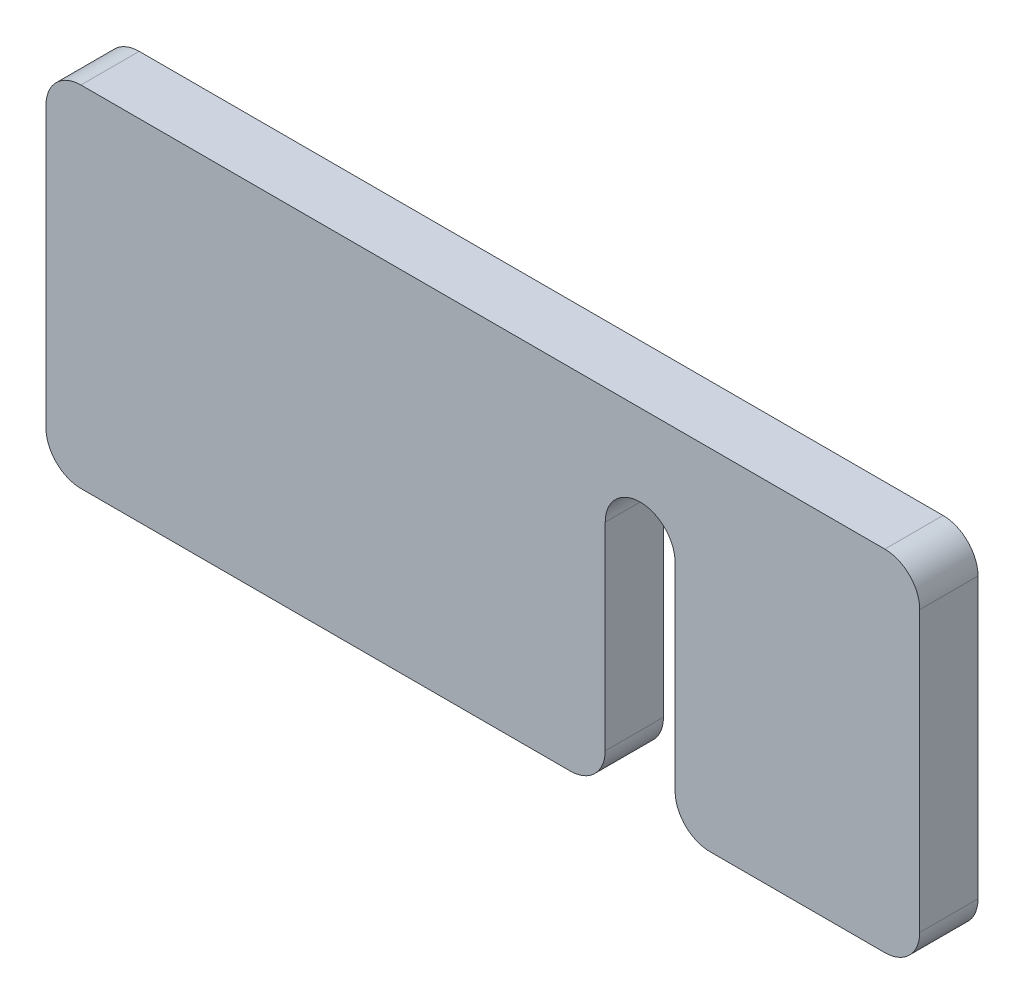
ISO-10303-21;
HEADER;
FILE_DESCRIPTION(('STEP AP214'),'2;1');
FILE_NAME('part.step','',(''),(''),'','','');
FILE_SCHEMA(('AUTOMOTIVE_DESIGN { 1 0 10303 214 1 1 1 1 }'));
ENDSEC;
DATA;
#1=APPLICATION_CONTEXT('core data for automotive mechanical design processes');
#2=APPLICATION_PROTOCOL_DEFINITION('international standard','automotive_design',2000,#1);
#3=PRODUCT_CONTEXT('',#1,'mechanical');
#4=PRODUCT('Part','Part','',(#3));
#5=PRODUCT_RELATED_PRODUCT_CATEGORY('part','',(#4));
#6=PRODUCT_DEFINITION_FORMATION('','',#4);
#7=PRODUCT_DEFINITION_CONTEXT('part definition',#1,'design');
#8=PRODUCT_DEFINITION('design','',#6,#7);
#9=PRODUCT_DEFINITION_SHAPE('','',#8);
#10=(LENGTH_UNIT() NAMED_UNIT(*) SI_UNIT(.MILLI.,.METRE.));
#11=(NAMED_UNIT(*) PLANE_ANGLE_UNIT() SI_UNIT($,.RADIAN.));
#12=(NAMED_UNIT(*) SI_UNIT($,.STERADIAN.) SOLID_ANGLE_UNIT());
#13=UNCERTAINTY_MEASURE_WITH_UNIT(LENGTH_MEASURE(1.E-05),#10,'distance_accuracy_value','');
#14=(GEOMETRIC_REPRESENTATION_CONTEXT(3) GLOBAL_UNCERTAINTY_ASSIGNED_CONTEXT((#13)) GLOBAL_UNIT_ASSIGNED_CONTEXT((#10,
#11,#12)) REPRESENTATION_CONTEXT('',''));
#15=CARTESIAN_POINT('',(0.,0.,0.));
#16=DIRECTION('',(0.,0.,1.));
#17=DIRECTION('',(1.,0.,0.));
#18=AXIS2_PLACEMENT_3D('',#15,#16,#17);
#19=CARTESIAN_POINT('',(37.5,-15.,2.5));
#20=DIRECTION('',(0.,1.,0.));
#21=DIRECTION('',(0.,0.,1.));
#22=AXIS2_PLACEMENT_3D('',#19,#20,#21);
#23=PLANE('',#22);
#24=DIRECTION('',(-1.,0.,0.));
#25=VECTOR('',#24,1.);
#26=CARTESIAN_POINT('',(37.5,-15.,-2.5));
#27=LINE('',#26,#25);
#28=CARTESIAN_POINT('',(34.5,-15.,-2.5));
#29=VERTEX_POINT('',#28);
#30=CARTESIAN_POINT('',(19.5,-15.,-2.5));
#31=VERTEX_POINT('',#30);
#32=EDGE_CURVE('E209',#29,#31,#27,.T.);
#33=ORIENTED_EDGE('',*,*,#32,.F.);
#34=DIRECTION('',(0.,0.,-1.));
#35=VECTOR('',#34,1.);
#36=CARTESIAN_POINT('',(34.5,-15.,2.5));
#37=LINE('',#36,#35);
#38=CARTESIAN_POINT('',(34.5,-15.,2.5));
#39=VERTEX_POINT('',#38);
#40=EDGE_CURVE('E247',#29,#39,#37,.F.);
#41=ORIENTED_EDGE('',*,*,#40,.T.);
#42=DIRECTION('',(-1.,0.,0.));
#43=VECTOR('',#42,1.);
#44=CARTESIAN_POINT('',(37.5,-15.,2.5));
#45=LINE('',#44,#43);
#46=CARTESIAN_POINT('',(19.5,-15.,2.5));
#47=VERTEX_POINT('',#46);
#48=EDGE_CURVE('E200',#39,#47,#45,.T.);
#49=ORIENTED_EDGE('',*,*,#48,.T.);
#50=DIRECTION('',(0.,0.,-1.));
#51=VECTOR('',#50,1.);
#52=CARTESIAN_POINT('',(19.5,-15.,2.5));
#53=LINE('',#52,#51);
#54=EDGE_CURVE('E244',#47,#31,#53,.T.);
#55=ORIENTED_EDGE('',*,*,#54,.T.);
#56=EDGE_LOOP('',(#33,#41,#49,#55));
#57=FACE_BOUND('',#56,.T.);
#58=ADVANCED_FACE('F51',(#57),#23,.F.);
#59=CARTESIAN_POINT('',(7.5,-15.,-2.5));
#60=VERTEX_POINT('',#59);
#61=CARTESIAN_POINT('',(-34.5,-15.,-2.5));
#62=VERTEX_POINT('',#61);
#63=EDGE_CURVE('E207',#60,#62,#27,.T.);
#64=ORIENTED_EDGE('',*,*,#63,.F.);
#65=DIRECTION('',(0.,0.,-1.));
#66=VECTOR('',#65,1.);
#67=CARTESIAN_POINT('',(7.5,-15.,2.5));
#68=LINE('',#67,#66);
#69=CARTESIAN_POINT('',(7.5,-15.,2.5));
#70=VERTEX_POINT('',#69);
#71=EDGE_CURVE('E256',#60,#70,#68,.F.);
#72=ORIENTED_EDGE('',*,*,#71,.T.);
#73=CARTESIAN_POINT('',(-34.5,-15.,2.5));
#74=VERTEX_POINT('',#73);
#75=EDGE_CURVE('E194',#70,#74,#45,.T.);
#76=ORIENTED_EDGE('',*,*,#75,.T.);
#77=DIRECTION('',(0.,0.,-1.));
#78=VECTOR('',#77,1.);
#79=CARTESIAN_POINT('',(-34.5,-15.,2.5));
#80=LINE('',#79,#78);
#81=EDGE_CURVE('E253',#74,#62,#80,.T.);
#82=ORIENTED_EDGE('',*,*,#81,.T.);
#83=EDGE_LOOP('',(#64,#72,#76,#82));
#84=FACE_BOUND('',#83,.T.);
#85=ADVANCED_FACE('F265',(#84),#23,.F.);
#86=CARTESIAN_POINT('',(37.5,-15.,-2.5));
#87=DIRECTION('',(0.,0.,1.));
#88=DIRECTION('',(1.,0.,0.));
#89=AXIS2_PLACEMENT_3D('',#86,#87,#88);
#90=PLANE('',#89);
#91=DIRECTION('',(-1.,0.,0.));
#92=VECTOR('',#91,1.);
#93=CARTESIAN_POINT('',(37.5,15.,-2.5));
#94=LINE('',#93,#92);
#95=CARTESIAN_POINT('',(34.5,15.,-2.5));
#96=VERTEX_POINT('',#95);
#97=CARTESIAN_POINT('',(-34.5,15.,-2.5));
#98=VERTEX_POINT('',#97);
#99=EDGE_CURVE('E204',#96,#98,#94,.T.);
#100=ORIENTED_EDGE('',*,*,#99,.F.);
#101=CARTESIAN_POINT('',(34.5,12.,-2.5));
#102=DIRECTION('',(0.,0.,1.));
#103=DIRECTION('',(1.,0.,0.));
#104=AXIS2_PLACEMENT_3D('',#101,#102,#103);
#105=CIRCLE('',#104,3.);
#106=CARTESIAN_POINT('',(37.5,12.,-2.5));
#107=VERTEX_POINT('',#106);
#108=EDGE_CURVE('E242',#96,#107,#105,.F.);
#109=ORIENTED_EDGE('',*,*,#108,.T.);
#110=DIRECTION('',(0.,1.,0.));
#111=VECTOR('',#110,1.);
#112=CARTESIAN_POINT('',(37.5,-15.,-2.5));
#113=LINE('',#112,#111);
#114=CARTESIAN_POINT('',(37.5,-12.,-2.5));
#115=VERTEX_POINT('',#114);
#116=EDGE_CURVE('E187',#115,#107,#113,.T.);
#117=ORIENTED_EDGE('',*,*,#116,.F.);
#118=CARTESIAN_POINT('',(34.5,-12.,-2.5));
#119=DIRECTION('',(0.,0.,1.));
#120=DIRECTION('',(1.,0.,0.));
#121=AXIS2_PLACEMENT_3D('',#118,#119,#120);
#122=CIRCLE('',#121,3.);
#123=EDGE_CURVE('E240',#115,#29,#122,.F.);
#124=ORIENTED_EDGE('',*,*,#123,.T.);
#125=ORIENTED_EDGE('',*,*,#32,.T.);
#126=CARTESIAN_POINT('',(19.5,-12.,-2.5));
#127=DIRECTION('',(0.,0.,1.));
#128=DIRECTION('',(1.,0.,0.));
#129=AXIS2_PLACEMENT_3D('',#126,#127,#128);
#130=CIRCLE('',#129,3.);
#131=CARTESIAN_POINT('',(16.5,-12.,-2.5));
#132=VERTEX_POINT('',#131);
#133=EDGE_CURVE('E238',#31,#132,#130,.F.);
#134=ORIENTED_EDGE('',*,*,#133,.T.);
#135=DIRECTION('',(0.,-1.,0.));
#136=VECTOR('',#135,1.);
#137=CARTESIAN_POINT('',(16.5,-15.,-2.5));
#138=LINE('',#137,#136);
#139=CARTESIAN_POINT('',(16.5,5.,-2.5));
#140=VERTEX_POINT('',#139);
#141=EDGE_CURVE('E182',#140,#132,#138,.T.);
#142=ORIENTED_EDGE('',*,*,#141,.F.);
#143=CARTESIAN_POINT('',(13.5,5.,-2.5));
#144=DIRECTION('',(0.,0.,-1.));
#145=DIRECTION('',(1.,0.,0.));
#146=AXIS2_PLACEMENT_3D('',#143,#144,#145);
#147=CIRCLE('',#146,3.);
#148=CARTESIAN_POINT('',(10.5,5.,-2.5));
#149=VERTEX_POINT('',#148);
#150=EDGE_CURVE('E159',#149,#140,#147,.T.);
#151=ORIENTED_EDGE('',*,*,#150,.F.);
#152=DIRECTION('',(0.,1.,0.));
#153=VECTOR('',#152,1.);
#154=CARTESIAN_POINT('',(10.5,-15.,-2.5));
#155=LINE('',#154,#153);
#156=CARTESIAN_POINT('',(10.5,-12.,-2.5));
#157=VERTEX_POINT('',#156);
#158=EDGE_CURVE('E184',#157,#149,#155,.T.);
#159=ORIENTED_EDGE('',*,*,#158,.F.);
#160=CARTESIAN_POINT('',(7.5,-12.,-2.5));
#161=DIRECTION('',(0.,0.,1.));
#162=DIRECTION('',(1.,0.,0.));
#163=AXIS2_PLACEMENT_3D('',#160,#161,#162);
#164=CIRCLE('',#163,3.);
#165=EDGE_CURVE('E236',#157,#60,#164,.F.);
#166=ORIENTED_EDGE('',*,*,#165,.T.);
#167=ORIENTED_EDGE('',*,*,#63,.T.);
#168=CARTESIAN_POINT('',(-34.5,-12.,-2.5));
#169=DIRECTION('',(0.,0.,1.));
#170=DIRECTION('',(1.,0.,0.));
#171=AXIS2_PLACEMENT_3D('',#168,#169,#170);
#172=CIRCLE('',#171,3.);
#173=CARTESIAN_POINT('',(-37.5,-12.,-2.5));
#174=VERTEX_POINT('',#173);
#175=EDGE_CURVE('E71',#62,#174,#172,.F.);
#176=ORIENTED_EDGE('',*,*,#175,.T.);
#177=DIRECTION('',(0.,1.,0.));
#178=VECTOR('',#177,1.);
#179=CARTESIAN_POINT('',(-37.5,-15.,-2.5));
#180=LINE('',#179,#178);
#181=CARTESIAN_POINT('',(-37.5,12.,-2.5));
#182=VERTEX_POINT('',#181);
#183=EDGE_CURVE('E163',#174,#182,#180,.T.);
#184=ORIENTED_EDGE('',*,*,#183,.T.);
#185=CARTESIAN_POINT('',(-34.5,12.,-2.5));
#186=DIRECTION('',(0.,0.,1.));
#187=DIRECTION('',(1.,0.,0.));
#188=AXIS2_PLACEMENT_3D('',#185,#186,#187);
#189=CIRCLE('',#188,3.);
#190=EDGE_CURVE('E234',#182,#98,#189,.F.);
#191=ORIENTED_EDGE('',*,*,#190,.T.);
#192=EDGE_LOOP('',(#100,#109,#117,#124,#125,#134,#142,#151,#159,#166,#167,#176,#184,#191));
#193=FACE_BOUND('',#192,.T.);
#194=ADVANCED_FACE('F268',(#193),#90,.F.);
#195=CARTESIAN_POINT('',(37.5,15.,2.5));
#196=DIRECTION('',(0.,-1.,0.));
#197=DIRECTION('',(0.,0.,-1.));
#198=AXIS2_PLACEMENT_3D('',#195,#196,#197);
#199=PLANE('',#198);
#200=DIRECTION('',(-1.,0.,0.));
#201=VECTOR('',#200,1.);
#202=CARTESIAN_POINT('',(37.5,15.,2.5));
#203=LINE('',#202,#201);
#204=CARTESIAN_POINT('',(34.5,15.,2.5));
#205=VERTEX_POINT('',#204);
#206=CARTESIAN_POINT('',(-34.5,15.,2.5));
#207=VERTEX_POINT('',#206);
#208=EDGE_CURVE('E201',#205,#207,#203,.T.);
#209=ORIENTED_EDGE('',*,*,#208,.F.);
#210=DIRECTION('',(0.,0.,1.));
#211=VECTOR('',#210,1.);
#212=CARTESIAN_POINT('',(34.5,15.,-2.5));
#213=LINE('',#212,#211);
#214=EDGE_CURVE('E231',#205,#96,#213,.F.);
#215=ORIENTED_EDGE('',*,*,#214,.T.);
#216=ORIENTED_EDGE('',*,*,#99,.T.);
#217=DIRECTION('',(0.,0.,1.));
#218=VECTOR('',#217,1.);
#219=CARTESIAN_POINT('',(-34.5,15.,2.5));
#220=LINE('',#219,#218);
#221=EDGE_CURVE('E228',#98,#207,#220,.T.);
#222=ORIENTED_EDGE('',*,*,#221,.T.);
#223=EDGE_LOOP('',(#209,#215,#216,#222));
#224=FACE_BOUND('',#223,.T.);
#225=ADVANCED_FACE('F299',(#224),#199,.F.);
#226=CARTESIAN_POINT('',(37.5,-15.,2.5));
#227=DIRECTION('',(0.,0.,-1.));
#228=DIRECTION('',(-1.,0.,0.));
#229=AXIS2_PLACEMENT_3D('',#226,#227,#228);
#230=PLANE('',#229);
#231=DIRECTION('',(0.,-1.,0.));
#232=VECTOR('',#231,1.);
#233=CARTESIAN_POINT('',(37.5,-15.,2.5));
#234=LINE('',#233,#232);
#235=CARTESIAN_POINT('',(37.5,12.,2.5));
#236=VERTEX_POINT('',#235);
#237=CARTESIAN_POINT('',(37.5,-12.,2.5));
#238=VERTEX_POINT('',#237);
#239=EDGE_CURVE('E190',#236,#238,#234,.T.);
#240=ORIENTED_EDGE('',*,*,#239,.F.);
#241=CARTESIAN_POINT('',(34.5,12.,2.5));
#242=DIRECTION('',(0.,0.,-1.));
#243=DIRECTION('',(-1.,0.,0.));
#244=AXIS2_PLACEMENT_3D('',#241,#242,#243);
#245=CIRCLE('',#244,3.);
#246=EDGE_CURVE('E226',#236,#205,#245,.F.);
#247=ORIENTED_EDGE('',*,*,#246,.T.);
#248=ORIENTED_EDGE('',*,*,#208,.T.);
#249=CARTESIAN_POINT('',(-34.5,12.,2.5));
#250=DIRECTION('',(0.,0.,-1.));
#251=DIRECTION('',(-1.,0.,0.));
#252=AXIS2_PLACEMENT_3D('',#249,#250,#251);
#253=CIRCLE('',#252,3.);
#254=CARTESIAN_POINT('',(-37.5,12.,2.5));
#255=VERTEX_POINT('',#254);
#256=EDGE_CURVE('E218',#207,#255,#253,.F.);
#257=ORIENTED_EDGE('',*,*,#256,.T.);
#258=DIRECTION('',(0.,-1.,0.));
#259=VECTOR('',#258,1.);
#260=CARTESIAN_POINT('',(-37.5,-15.,2.5));
#261=LINE('',#260,#259);
#262=CARTESIAN_POINT('',(-37.5,-12.,2.5));
#263=VERTEX_POINT('',#262);
#264=EDGE_CURVE('E191',#255,#263,#261,.T.);
#265=ORIENTED_EDGE('',*,*,#264,.T.);
#266=CARTESIAN_POINT('',(-34.5,-12.,2.5));
#267=DIRECTION('',(0.,0.,-1.));
#268=DIRECTION('',(-1.,0.,0.));
#269=AXIS2_PLACEMENT_3D('',#266,#267,#268);
#270=CIRCLE('',#269,3.);
#271=EDGE_CURVE('E216',#263,#74,#270,.F.);
#272=ORIENTED_EDGE('',*,*,#271,.T.);
#273=ORIENTED_EDGE('',*,*,#75,.F.);
#274=CARTESIAN_POINT('',(7.5,-12.,2.5));
#275=DIRECTION('',(0.,0.,-1.));
#276=DIRECTION('',(-1.,0.,0.));
#277=AXIS2_PLACEMENT_3D('',#274,#275,#276);
#278=CIRCLE('',#277,3.);
#279=CARTESIAN_POINT('',(10.5,-12.,2.5));
#280=VERTEX_POINT('',#279);
#281=EDGE_CURVE('E220',#70,#280,#278,.F.);
#282=ORIENTED_EDGE('',*,*,#281,.T.);
#283=DIRECTION('',(0.,1.,0.));
#284=VECTOR('',#283,1.);
#285=CARTESIAN_POINT('',(10.5,-15.,2.5));
#286=LINE('',#285,#284);
#287=CARTESIAN_POINT('',(10.5,5.,2.5));
#288=VERTEX_POINT('',#287);
#289=EDGE_CURVE('E173',#280,#288,#286,.T.);
#290=ORIENTED_EDGE('',*,*,#289,.T.);
#291=CARTESIAN_POINT('',(13.5,5.,2.5));
#292=DIRECTION('',(0.,0.,-1.));
#293=DIRECTION('',(1.,0.,0.));
#294=AXIS2_PLACEMENT_3D('',#291,#292,#293);
#295=CIRCLE('',#294,3.);
#296=CARTESIAN_POINT('',(16.5,5.,2.5));
#297=VERTEX_POINT('',#296);
#298=EDGE_CURVE('E156',#288,#297,#295,.T.);
#299=ORIENTED_EDGE('',*,*,#298,.T.);
#300=DIRECTION('',(0.,-1.,0.));
#301=VECTOR('',#300,1.);
#302=CARTESIAN_POINT('',(16.5,-15.,2.5));
#303=LINE('',#302,#301);
#304=CARTESIAN_POINT('',(16.5,-12.,2.5));
#305=VERTEX_POINT('',#304);
#306=EDGE_CURVE('E167',#297,#305,#303,.T.);
#307=ORIENTED_EDGE('',*,*,#306,.T.);
#308=CARTESIAN_POINT('',(19.5,-12.,2.5));
#309=DIRECTION('',(0.,0.,-1.));
#310=DIRECTION('',(-1.,0.,0.));
#311=AXIS2_PLACEMENT_3D('',#308,#309,#310);
#312=CIRCLE('',#311,3.);
#313=EDGE_CURVE('E222',#305,#47,#312,.F.);
#314=ORIENTED_EDGE('',*,*,#313,.T.);
#315=ORIENTED_EDGE('',*,*,#48,.F.);
#316=CARTESIAN_POINT('',(34.5,-12.,2.5));
#317=DIRECTION('',(0.,0.,-1.));
#318=DIRECTION('',(-1.,0.,0.));
#319=AXIS2_PLACEMENT_3D('',#316,#317,#318);
#320=CIRCLE('',#319,3.);
#321=EDGE_CURVE('E224',#39,#238,#320,.F.);
#322=ORIENTED_EDGE('',*,*,#321,.T.);
#323=EDGE_LOOP('',(#240,#247,#248,#257,#265,#272,#273,#282,#290,#299,#307,#314,#315,#322));
#324=FACE_BOUND('',#323,.T.);
#325=ADVANCED_FACE('F176',(#324),#230,.F.);
#326=CARTESIAN_POINT('',(37.5,-15.,-2.5));
#327=DIRECTION('',(1.,0.,0.));
#328=DIRECTION('',(0.,0.,-1.));
#329=AXIS2_PLACEMENT_3D('',#326,#327,#328);
#330=PLANE('',#329);
#331=ORIENTED_EDGE('',*,*,#116,.T.);
#332=DIRECTION('',(0.,0.,1.));
#333=VECTOR('',#332,1.);
#334=CARTESIAN_POINT('',(37.5,12.,2.5));
#335=LINE('',#334,#333);
#336=EDGE_CURVE('E213',#107,#236,#335,.T.);
#337=ORIENTED_EDGE('',*,*,#336,.T.);
#338=ORIENTED_EDGE('',*,*,#239,.T.);
#339=DIRECTION('',(0.,0.,-1.));
#340=VECTOR('',#339,1.);
#341=CARTESIAN_POINT('',(37.5,-12.,-2.5));
#342=LINE('',#341,#340);
#343=EDGE_CURVE('E210',#238,#115,#342,.T.);
#344=ORIENTED_EDGE('',*,*,#343,.T.);
#345=EDGE_LOOP('',(#331,#337,#338,#344));
#346=FACE_BOUND('',#345,.T.);
#347=ADVANCED_FACE('F290',(#346),#330,.T.);
#348=CARTESIAN_POINT('',(-37.5,-15.,-2.5));
#349=DIRECTION('',(1.,0.,0.));
#350=DIRECTION('',(0.,0.,-1.));
#351=AXIS2_PLACEMENT_3D('',#348,#349,#350);
#352=PLANE('',#351);
#353=ORIENTED_EDGE('',*,*,#264,.F.);
#354=DIRECTION('',(0.,0.,1.));
#355=VECTOR('',#354,1.);
#356=CARTESIAN_POINT('',(-37.5,12.,-2.5));
#357=LINE('',#356,#355);
#358=EDGE_CURVE('E12',#255,#182,#357,.F.);
#359=ORIENTED_EDGE('',*,*,#358,.T.);
#360=ORIENTED_EDGE('',*,*,#183,.F.);
#361=DIRECTION('',(0.,0.,-1.));
#362=VECTOR('',#361,1.);
#363=CARTESIAN_POINT('',(-37.5,-12.,-2.5));
#364=LINE('',#363,#362);
#365=EDGE_CURVE('E59',#174,#263,#364,.F.);
#366=ORIENTED_EDGE('',*,*,#365,.T.);
#367=EDGE_LOOP('',(#353,#359,#360,#366));
#368=FACE_BOUND('',#367,.T.);
#369=ADVANCED_FACE('F258',(#368),#352,.F.);
#370=CARTESIAN_POINT('',(16.5,-15.,2.5));
#371=DIRECTION('',(1.,0.,0.));
#372=DIRECTION('',(0.,0.,-1.));
#373=AXIS2_PLACEMENT_3D('',#370,#371,#372);
#374=PLANE('',#373);
#375=ORIENTED_EDGE('',*,*,#141,.T.);
#376=DIRECTION('',(0.,0.,-1.));
#377=VECTOR('',#376,1.);
#378=CARTESIAN_POINT('',(16.5,-12.,2.5));
#379=LINE('',#378,#377);
#380=EDGE_CURVE('E170',#132,#305,#379,.F.);
#381=ORIENTED_EDGE('',*,*,#380,.T.);
#382=ORIENTED_EDGE('',*,*,#306,.F.);
#383=DIRECTION('',(0.,0.,-1.));
#384=VECTOR('',#383,1.);
#385=CARTESIAN_POINT('',(16.5,5.,2.5));
#386=LINE('',#385,#384);
#387=EDGE_CURVE('E151',#297,#140,#386,.T.);
#388=ORIENTED_EDGE('',*,*,#387,.T.);
#389=EDGE_LOOP('',(#375,#381,#382,#388));
#390=FACE_BOUND('',#389,.T.);
#391=ADVANCED_FACE('F168',(#390),#374,.F.);
#392=CARTESIAN_POINT('',(13.5,5.,2.5));
#393=DIRECTION('',(0.,0.,-1.));
#394=DIRECTION('',(-1.,0.,0.));
#395=AXIS2_PLACEMENT_3D('',#392,#393,#394);
#396=CYLINDRICAL_SURFACE('',#395,3.);
#397=ORIENTED_EDGE('',*,*,#150,.T.);
#398=ORIENTED_EDGE('',*,*,#387,.F.);
#399=ORIENTED_EDGE('',*,*,#298,.F.);
#400=DIRECTION('',(0.,0.,-1.));
#401=VECTOR('',#400,1.);
#402=CARTESIAN_POINT('',(10.5,5.,2.5));
#403=LINE('',#402,#401);
#404=EDGE_CURVE('E164',#288,#149,#403,.T.);
#405=ORIENTED_EDGE('',*,*,#404,.T.);
#406=EDGE_LOOP('',(#397,#398,#399,#405));
#407=FACE_BOUND('',#406,.T.);
#408=ADVANCED_FACE('F153',(#407),#396,.F.);
#409=CARTESIAN_POINT('',(10.5,-15.,2.5));
#410=DIRECTION('',(-1.,0.,0.));
#411=DIRECTION('',(0.,-1.,0.));
#412=AXIS2_PLACEMENT_3D('',#409,#410,#411);
#413=PLANE('',#412);
#414=ORIENTED_EDGE('',*,*,#289,.F.);
#415=DIRECTION('',(0.,0.,-1.));
#416=VECTOR('',#415,1.);
#417=CARTESIAN_POINT('',(10.5,-12.,2.5));
#418=LINE('',#417,#416);
#419=EDGE_CURVE('E250',#280,#157,#418,.T.);
#420=ORIENTED_EDGE('',*,*,#419,.T.);
#421=ORIENTED_EDGE('',*,*,#158,.T.);
#422=ORIENTED_EDGE('',*,*,#404,.F.);
#423=EDGE_LOOP('',(#414,#420,#421,#422));
#424=FACE_BOUND('',#423,.T.);
#425=ADVANCED_FACE('F275',(#424),#413,.F.);
#426=CARTESIAN_POINT('',(34.5,12.,-2.5));
#427=DIRECTION('',(0.,0.,-1.));
#428=DIRECTION('',(-1.,0.,0.));
#429=AXIS2_PLACEMENT_3D('',#426,#427,#428);
#430=CYLINDRICAL_SURFACE('',#429,3.);
#431=ORIENTED_EDGE('',*,*,#108,.F.);
#432=ORIENTED_EDGE('',*,*,#214,.F.);
#433=ORIENTED_EDGE('',*,*,#246,.F.);
#434=ORIENTED_EDGE('',*,*,#336,.F.);
#435=EDGE_LOOP('',(#431,#432,#433,#434));
#436=FACE_BOUND('',#435,.T.);
#437=ADVANCED_FACE('F295',(#436),#430,.T.);
#438=CARTESIAN_POINT('',(34.5,-12.,-2.5));
#439=DIRECTION('',(0.,0.,1.));
#440=DIRECTION('',(1.,0.,0.));
#441=AXIS2_PLACEMENT_3D('',#438,#439,#440);
#442=CYLINDRICAL_SURFACE('',#441,3.);
#443=ORIENTED_EDGE('',*,*,#321,.F.);
#444=ORIENTED_EDGE('',*,*,#40,.F.);
#445=ORIENTED_EDGE('',*,*,#123,.F.);
#446=ORIENTED_EDGE('',*,*,#343,.F.);
#447=EDGE_LOOP('',(#443,#444,#445,#446));
#448=FACE_BOUND('',#447,.T.);
#449=ADVANCED_FACE('F287',(#448),#442,.T.);
#450=CARTESIAN_POINT('',(19.5,-12.,2.5));
#451=DIRECTION('',(0.,0.,-1.));
#452=DIRECTION('',(-1.,0.,0.));
#453=AXIS2_PLACEMENT_3D('',#450,#451,#452);
#454=CYLINDRICAL_SURFACE('',#453,3.);
#455=ORIENTED_EDGE('',*,*,#313,.F.);
#456=ORIENTED_EDGE('',*,*,#380,.F.);
#457=ORIENTED_EDGE('',*,*,#133,.F.);
#458=ORIENTED_EDGE('',*,*,#54,.F.);
#459=EDGE_LOOP('',(#455,#456,#457,#458));
#460=FACE_BOUND('',#459,.T.);
#461=ADVANCED_FACE('F278',(#460),#454,.T.);
#462=CARTESIAN_POINT('',(7.5,-12.,2.5));
#463=DIRECTION('',(0.,0.,-1.));
#464=DIRECTION('',(-1.,0.,0.));
#465=AXIS2_PLACEMENT_3D('',#462,#463,#464);
#466=CYLINDRICAL_SURFACE('',#465,3.);
#467=ORIENTED_EDGE('',*,*,#281,.F.);
#468=ORIENTED_EDGE('',*,*,#71,.F.);
#469=ORIENTED_EDGE('',*,*,#165,.F.);
#470=ORIENTED_EDGE('',*,*,#419,.F.);
#471=EDGE_LOOP('',(#467,#468,#469,#470));
#472=FACE_BOUND('',#471,.T.);
#473=ADVANCED_FACE('F273',(#472),#466,.T.);
#474=CARTESIAN_POINT('',(-34.5,12.,2.5));
#475=DIRECTION('',(0.,0.,1.));
#476=DIRECTION('',(1.,0.,0.));
#477=AXIS2_PLACEMENT_3D('',#474,#475,#476);
#478=CYLINDRICAL_SURFACE('',#477,3.);
#479=ORIENTED_EDGE('',*,*,#190,.F.);
#480=ORIENTED_EDGE('',*,*,#358,.F.);
#481=ORIENTED_EDGE('',*,*,#256,.F.);
#482=ORIENTED_EDGE('',*,*,#221,.F.);
#483=EDGE_LOOP('',(#479,#480,#481,#482));
#484=FACE_BOUND('',#483,.T.);
#485=ADVANCED_FACE('F303',(#484),#478,.T.);
#486=CARTESIAN_POINT('',(-34.5,-12.,2.5));
#487=DIRECTION('',(0.,0.,-1.));
#488=DIRECTION('',(-1.,0.,0.));
#489=AXIS2_PLACEMENT_3D('',#486,#487,#488);
#490=CYLINDRICAL_SURFACE('',#489,3.);
#491=ORIENTED_EDGE('',*,*,#271,.F.);
#492=ORIENTED_EDGE('',*,*,#365,.F.);
#493=ORIENTED_EDGE('',*,*,#175,.F.);
#494=ORIENTED_EDGE('',*,*,#81,.F.);
#495=EDGE_LOOP('',(#491,#492,#493,#494));
#496=FACE_BOUND('',#495,.T.);
#497=ADVANCED_FACE('F53',(#496),#490,.T.);
#498=CLOSED_SHELL('',(#58,#85,#194,#225,#325,#347,#369,#391,#408,#425,#437,#449,#461,#473,#485,#497));
#499=MANIFOLD_SOLID_BREP('B2',#498);
#500=ADVANCED_BREP_SHAPE_REPRESENTATION('',(#18,#499),#14);
#501=SHAPE_DEFINITION_REPRESENTATION(#9,#500);
ENDSEC;
END-ISO-10303-21;
